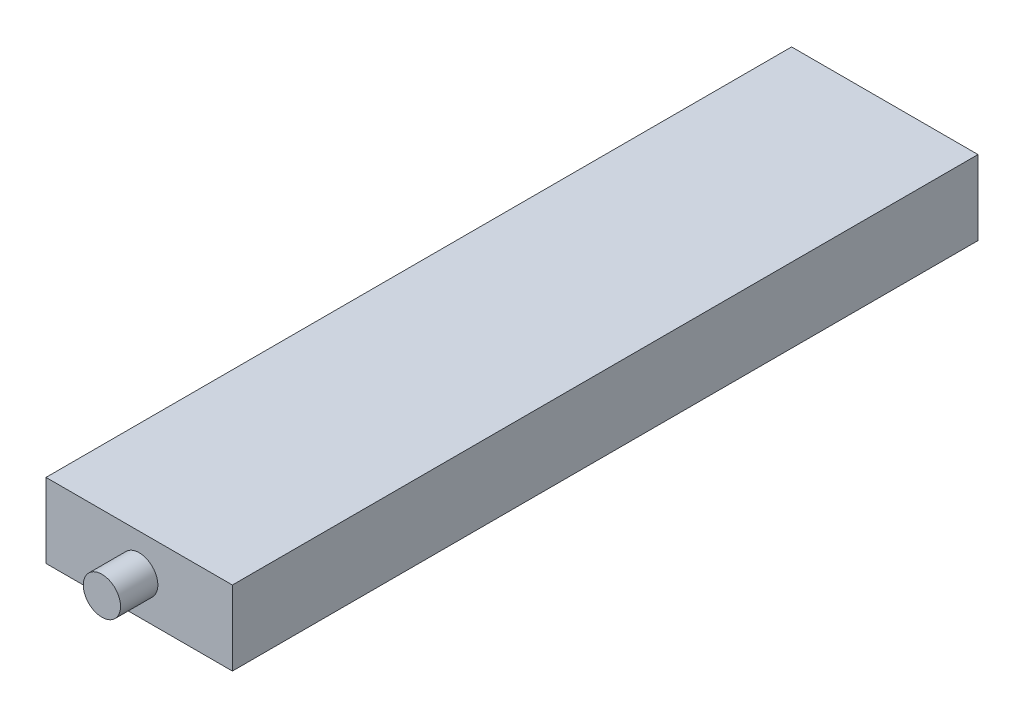
ISO-10303-21;
HEADER;
FILE_DESCRIPTION(('STEP AP214'),'2;1');
FILE_NAME('part.step','',(''),(''),'','','');
FILE_SCHEMA(('AUTOMOTIVE_DESIGN { 1 0 10303 214 1 1 1 1 }'));
ENDSEC;
DATA;
#1=APPLICATION_CONTEXT('core data for automotive mechanical design processes');
#2=APPLICATION_PROTOCOL_DEFINITION('international standard','automotive_design',2000,#1);
#3=PRODUCT_CONTEXT('',#1,'mechanical');
#4=PRODUCT('Part','Part','',(#3));
#5=PRODUCT_RELATED_PRODUCT_CATEGORY('part','',(#4));
#6=PRODUCT_DEFINITION_FORMATION('','',#4);
#7=PRODUCT_DEFINITION_CONTEXT('part definition',#1,'design');
#8=PRODUCT_DEFINITION('design','',#6,#7);
#9=PRODUCT_DEFINITION_SHAPE('','',#8);
#10=(LENGTH_UNIT() NAMED_UNIT(*) SI_UNIT(.MILLI.,.METRE.));
#11=(NAMED_UNIT(*) PLANE_ANGLE_UNIT() SI_UNIT($,.RADIAN.));
#12=(NAMED_UNIT(*) SI_UNIT($,.STERADIAN.) SOLID_ANGLE_UNIT());
#13=UNCERTAINTY_MEASURE_WITH_UNIT(LENGTH_MEASURE(1.E-05),#10,'distance_accuracy_value','');
#14=(GEOMETRIC_REPRESENTATION_CONTEXT(3) GLOBAL_UNCERTAINTY_ASSIGNED_CONTEXT((#13)) GLOBAL_UNIT_ASSIGNED_CONTEXT((#10,
#11,#12)) REPRESENTATION_CONTEXT('',''));
#15=CARTESIAN_POINT('',(0.,0.,0.));
#16=DIRECTION('',(0.,0.,1.));
#17=DIRECTION('',(1.,0.,0.));
#18=AXIS2_PLACEMENT_3D('',#15,#16,#17);
#19=CARTESIAN_POINT('',(50.,10.,0.));
#20=DIRECTION('',(0.,0.,1.));
#21=DIRECTION('',(1.,0.,0.));
#22=AXIS2_PLACEMENT_3D('',#19,#20,#21);
#23=PLANE('',#22);
#24=DIRECTION('',(-1.,0.,0.));
#25=VECTOR('',#24,1.);
#26=CARTESIAN_POINT('',(50.,-10.,0.));
#27=LINE('',#26,#25);
#28=CARTESIAN_POINT('',(50.,-10.,0.));
#29=VERTEX_POINT('',#28);
#30=CARTESIAN_POINT('',(0.,-10.,0.));
#31=VERTEX_POINT('',#30);
#32=EDGE_CURVE('E110',#29,#31,#27,.T.);
#33=ORIENTED_EDGE('',*,*,#32,.T.);
#34=DIRECTION('',(0.,-1.,0.));
#35=VECTOR('',#34,1.);
#36=CARTESIAN_POINT('',(0.,10.,0.));
#37=LINE('',#36,#35);
#38=CARTESIAN_POINT('',(0.,10.,0.));
#39=VERTEX_POINT('',#38);
#40=EDGE_CURVE('E48',#39,#31,#37,.T.);
#41=ORIENTED_EDGE('',*,*,#40,.F.);
#42=DIRECTION('',(-1.,0.,0.));
#43=VECTOR('',#42,1.);
#44=CARTESIAN_POINT('',(50.,10.,0.));
#45=LINE('',#44,#43);
#46=CARTESIAN_POINT('',(50.,10.,0.));
#47=VERTEX_POINT('',#46);
#48=EDGE_CURVE('E92',#47,#39,#45,.T.);
#49=ORIENTED_EDGE('',*,*,#48,.F.);
#50=DIRECTION('',(0.,-1.,0.));
#51=VECTOR('',#50,1.);
#52=CARTESIAN_POINT('',(50.,10.,0.));
#53=LINE('',#52,#51);
#54=EDGE_CURVE('E106',#47,#29,#53,.T.);
#55=ORIENTED_EDGE('',*,*,#54,.T.);
#56=EDGE_LOOP('',(#33,#41,#49,#55));
#57=FACE_BOUND('',#56,.T.);
#58=ADVANCED_FACE('F39',(#57),#23,.F.);
#59=CARTESIAN_POINT('',(0.,10.,0.));
#60=DIRECTION('',(1.,0.,0.));
#61=DIRECTION('',(0.,0.,-1.));
#62=AXIS2_PLACEMENT_3D('',#59,#60,#61);
#63=PLANE('',#62);
#64=DIRECTION('',(0.,0.,1.));
#65=VECTOR('',#64,1.);
#66=CARTESIAN_POINT('',(0.,-10.,0.));
#67=LINE('',#66,#65);
#68=CARTESIAN_POINT('',(0.,-10.,200.));
#69=VERTEX_POINT('',#68);
#70=EDGE_CURVE('E98',#31,#69,#67,.T.);
#71=ORIENTED_EDGE('',*,*,#70,.T.);
#72=DIRECTION('',(0.,-1.,0.));
#73=VECTOR('',#72,1.);
#74=CARTESIAN_POINT('',(0.,10.,200.));
#75=LINE('',#74,#73);
#76=CARTESIAN_POINT('',(0.,10.,200.));
#77=VERTEX_POINT('',#76);
#78=EDGE_CURVE('E96',#77,#69,#75,.T.);
#79=ORIENTED_EDGE('',*,*,#78,.F.);
#80=DIRECTION('',(0.,0.,1.));
#81=VECTOR('',#80,1.);
#82=CARTESIAN_POINT('',(0.,10.,0.));
#83=LINE('',#82,#81);
#84=EDGE_CURVE('E87',#39,#77,#83,.T.);
#85=ORIENTED_EDGE('',*,*,#84,.F.);
#86=ORIENTED_EDGE('',*,*,#40,.T.);
#87=EDGE_LOOP('',(#71,#79,#85,#86));
#88=FACE_BOUND('',#87,.T.);
#89=ADVANCED_FACE('F97',(#88),#63,.F.);
#90=CARTESIAN_POINT('',(0.,10.,200.));
#91=DIRECTION('',(0.,0.,-1.));
#92=DIRECTION('',(-1.,0.,0.));
#93=AXIS2_PLACEMENT_3D('',#90,#91,#92);
#94=PLANE('',#93);
#95=CARTESIAN_POINT('',(25.,0.,200.));
#96=DIRECTION('',(0.,0.,-1.));
#97=DIRECTION('',(-1.,0.,0.));
#98=AXIS2_PLACEMENT_3D('',#95,#96,#97);
#99=CIRCLE('',#98,5.);
#100=CARTESIAN_POINT('',(20.,0.,200.));
#101=VERTEX_POINT('',#100);
#102=EDGE_CURVE('E11',#101,#101,#99,.F.);
#103=ORIENTED_EDGE('',*,*,#102,.F.);
#104=EDGE_LOOP('',(#103));
#105=FACE_BOUND('',#104,.T.);
#106=DIRECTION('',(1.,0.,0.));
#107=VECTOR('',#106,1.);
#108=CARTESIAN_POINT('',(0.,-10.,200.));
#109=LINE('',#108,#107);
#110=CARTESIAN_POINT('',(50.,-10.,200.));
#111=VERTEX_POINT('',#110);
#112=EDGE_CURVE('E73',#69,#111,#109,.T.);
#113=ORIENTED_EDGE('',*,*,#112,.T.);
#114=DIRECTION('',(0.,-1.,0.));
#115=VECTOR('',#114,1.);
#116=CARTESIAN_POINT('',(50.,10.,200.));
#117=LINE('',#116,#115);
#118=CARTESIAN_POINT('',(50.,10.,200.));
#119=VERTEX_POINT('',#118);
#120=EDGE_CURVE('E100',#119,#111,#117,.T.);
#121=ORIENTED_EDGE('',*,*,#120,.F.);
#122=DIRECTION('',(1.,0.,0.));
#123=VECTOR('',#122,1.);
#124=CARTESIAN_POINT('',(0.,10.,200.));
#125=LINE('',#124,#123);
#126=EDGE_CURVE('E90',#77,#119,#125,.T.);
#127=ORIENTED_EDGE('',*,*,#126,.F.);
#128=ORIENTED_EDGE('',*,*,#78,.T.);
#129=EDGE_LOOP('',(#113,#121,#127,#128));
#130=FACE_BOUND('',#129,.T.);
#131=ADVANCED_FACE('F102',(#105,#130),#94,.F.);
#132=CARTESIAN_POINT('',(50.,10.,200.));
#133=DIRECTION('',(-1.,0.,0.));
#134=DIRECTION('',(0.,0.,1.));
#135=AXIS2_PLACEMENT_3D('',#132,#133,#134);
#136=PLANE('',#135);
#137=DIRECTION('',(0.,0.,-1.));
#138=VECTOR('',#137,1.);
#139=CARTESIAN_POINT('',(50.,-10.,200.));
#140=LINE('',#139,#138);
#141=EDGE_CURVE('E79',#111,#29,#140,.T.);
#142=ORIENTED_EDGE('',*,*,#141,.T.);
#143=ORIENTED_EDGE('',*,*,#54,.F.);
#144=DIRECTION('',(0.,0.,-1.));
#145=VECTOR('',#144,1.);
#146=CARTESIAN_POINT('',(50.,10.,200.));
#147=LINE('',#146,#145);
#148=EDGE_CURVE('E56',#119,#47,#147,.T.);
#149=ORIENTED_EDGE('',*,*,#148,.F.);
#150=ORIENTED_EDGE('',*,*,#120,.T.);
#151=EDGE_LOOP('',(#142,#143,#149,#150));
#152=FACE_BOUND('',#151,.T.);
#153=ADVANCED_FACE('F139',(#152),#136,.F.);
#154=CARTESIAN_POINT('',(0.,10.,0.));
#155=DIRECTION('',(0.,1.,0.));
#156=DIRECTION('',(0.,0.,1.));
#157=AXIS2_PLACEMENT_3D('',#154,#155,#156);
#158=PLANE('',#157);
#159=ORIENTED_EDGE('',*,*,#48,.T.);
#160=ORIENTED_EDGE('',*,*,#84,.T.);
#161=ORIENTED_EDGE('',*,*,#126,.T.);
#162=ORIENTED_EDGE('',*,*,#148,.T.);
#163=EDGE_LOOP('',(#159,#160,#161,#162));
#164=FACE_BOUND('',#163,.T.);
#165=ADVANCED_FACE('F88',(#164),#158,.T.);
#166=CARTESIAN_POINT('',(0.,-10.,0.));
#167=DIRECTION('',(0.,1.,0.));
#168=DIRECTION('',(0.,0.,1.));
#169=AXIS2_PLACEMENT_3D('',#166,#167,#168);
#170=PLANE('',#169);
#171=ORIENTED_EDGE('',*,*,#32,.F.);
#172=ORIENTED_EDGE('',*,*,#141,.F.);
#173=ORIENTED_EDGE('',*,*,#112,.F.);
#174=ORIENTED_EDGE('',*,*,#70,.F.);
#175=EDGE_LOOP('',(#171,#172,#173,#174));
#176=FACE_BOUND('',#175,.T.);
#177=ADVANCED_FACE('F128',(#176),#170,.F.);
#178=CARTESIAN_POINT('',(25.,0.,210.));
#179=DIRECTION('',(0.,0.,-1.));
#180=DIRECTION('',(-1.,0.,0.));
#181=AXIS2_PLACEMENT_3D('',#178,#179,#180);
#182=CYLINDRICAL_SURFACE('',#181,5.);
#183=CARTESIAN_POINT('',(25.,0.,210.));
#184=DIRECTION('',(0.,0.,1.));
#185=DIRECTION('',(1.,0.,0.));
#186=AXIS2_PLACEMENT_3D('',#183,#184,#185);
#187=CIRCLE('',#186,5.);
#188=CARTESIAN_POINT('',(30.,0.,210.));
#189=VERTEX_POINT('',#188);
#190=EDGE_CURVE('E114',#189,#189,#187,.T.);
#191=ORIENTED_EDGE('',*,*,#190,.F.);
#192=EDGE_LOOP('',(#191));
#193=FACE_BOUND('',#192,.T.);
#194=ORIENTED_EDGE('',*,*,#102,.T.);
#195=EDGE_LOOP('',(#194));
#196=FACE_BOUND('',#195,.T.);
#197=ADVANCED_FACE('F130',(#193,#196),#182,.T.);
#198=CARTESIAN_POINT('',(25.,0.,210.));
#199=DIRECTION('',(0.,0.,1.));
#200=DIRECTION('',(1.,0.,0.));
#201=AXIS2_PLACEMENT_3D('',#198,#199,#200);
#202=PLANE('',#201);
#203=ORIENTED_EDGE('',*,*,#190,.T.);
#204=EDGE_LOOP('',(#203));
#205=FACE_BOUND('',#204,.T.);
#206=ADVANCED_FACE('F136',(#205),#202,.T.);
#207=CLOSED_SHELL('',(#58,#89,#131,#153,#165,#177,#197,#206));
#208=MANIFOLD_SOLID_BREP('B2',#207);
#209=ADVANCED_BREP_SHAPE_REPRESENTATION('',(#18,#208),#14);
#210=SHAPE_DEFINITION_REPRESENTATION(#9,#209);
ENDSEC;
END-ISO-10303-21;
